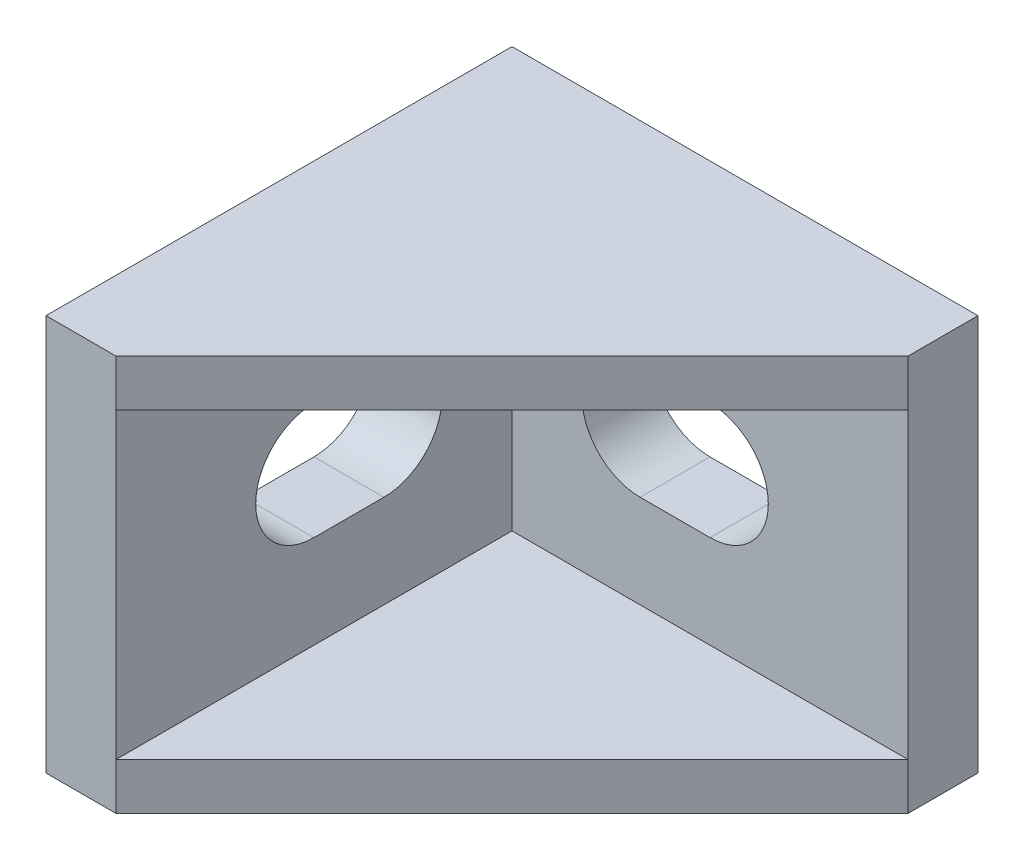
ISO-10303-21;
HEADER;
FILE_DESCRIPTION(('STEP AP214'),'2;1');
FILE_NAME('part.step','',(''),(''),'','','');
FILE_SCHEMA(('AUTOMOTIVE_DESIGN { 1 0 10303 214 1 1 1 1 }'));
ENDSEC;
DATA;
#1=APPLICATION_CONTEXT('core data for automotive mechanical design processes');
#2=APPLICATION_PROTOCOL_DEFINITION('international standard','automotive_design',2000,#1);
#3=PRODUCT_CONTEXT('',#1,'mechanical');
#4=PRODUCT('Part','Part','',(#3));
#5=PRODUCT_RELATED_PRODUCT_CATEGORY('part','',(#4));
#6=PRODUCT_DEFINITION_FORMATION('','',#4);
#7=PRODUCT_DEFINITION_CONTEXT('part definition',#1,'design');
#8=PRODUCT_DEFINITION('design','',#6,#7);
#9=PRODUCT_DEFINITION_SHAPE('','',#8);
#10=(LENGTH_UNIT() NAMED_UNIT(*) SI_UNIT(.MILLI.,.METRE.));
#11=(NAMED_UNIT(*) PLANE_ANGLE_UNIT() SI_UNIT($,.RADIAN.));
#12=(NAMED_UNIT(*) SI_UNIT($,.STERADIAN.) SOLID_ANGLE_UNIT());
#13=UNCERTAINTY_MEASURE_WITH_UNIT(LENGTH_MEASURE(1.E-05),#10,'distance_accuracy_value','');
#14=(GEOMETRIC_REPRESENTATION_CONTEXT(3) GLOBAL_UNCERTAINTY_ASSIGNED_CONTEXT((#13)) GLOBAL_UNIT_ASSIGNED_CONTEXT((#10,
#11,#12)) REPRESENTATION_CONTEXT('',''));
#15=CARTESIAN_POINT('',(0.,0.,0.));
#16=DIRECTION('',(0.,0.,1.));
#17=DIRECTION('',(1.,0.,0.));
#18=AXIS2_PLACEMENT_3D('',#15,#16,#17);
#19=CARTESIAN_POINT('',(10.,2.,10.));
#20=DIRECTION('',(0.,1.,0.));
#21=DIRECTION('',(1.,0.,0.));
#22=AXIS2_PLACEMENT_3D('',#19,#20,#21);
#23=PLANE('',#22);
#24=DIRECTION('',(0.,0.,1.));
#25=VECTOR('',#24,1.);
#26=CARTESIAN_POINT('',(3.,2.,15.));
#27=LINE('',#26,#25);
#28=CARTESIAN_POINT('',(3.,2.,3.00000004470348));
#29=VERTEX_POINT('',#28);
#30=CARTESIAN_POINT('',(3.,2.,20.));
#31=VERTEX_POINT('',#30);
#32=EDGE_CURVE('E212',#29,#31,#27,.T.);
#33=ORIENTED_EDGE('',*,*,#32,.T.);
#34=DIRECTION('',(0.707106781186548,0.,-0.707106781186547));
#35=VECTOR('',#34,1.);
#36=CARTESIAN_POINT('',(20.,2.,3.));
#37=LINE('',#36,#35);
#38=CARTESIAN_POINT('',(20.,2.,3.));
#39=VERTEX_POINT('',#38);
#40=EDGE_CURVE('E24',#31,#39,#37,.T.);
#41=ORIENTED_EDGE('',*,*,#40,.T.);
#42=DIRECTION('',(-1.,0.,2.62961665514434E-09));
#43=VECTOR('',#42,1.);
#44=CARTESIAN_POINT('',(6.49999999079634,2.,3.00000003549983));
#45=LINE('',#44,#43);
#46=EDGE_CURVE('E309',#39,#29,#45,.T.);
#47=ORIENTED_EDGE('',*,*,#46,.T.);
#48=EDGE_LOOP('',(#33,#41,#47));
#49=FACE_BOUND('',#48,.T.);
#50=ADVANCED_FACE('F16',(#49),#23,.T.);
#51=CARTESIAN_POINT('',(0.,0.,20.));
#52=DIRECTION('',(0.,0.,1.));
#53=DIRECTION('',(1.,0.,0.));
#54=AXIS2_PLACEMENT_3D('',#51,#52,#53);
#55=PLANE('',#54);
#56=DIRECTION('',(-1.,0.,0.));
#57=VECTOR('',#56,1.);
#58=CARTESIAN_POINT('',(3.,0.,20.));
#59=LINE('',#58,#57);
#60=CARTESIAN_POINT('',(3.,0.,20.));
#61=VERTEX_POINT('',#60);
#62=CARTESIAN_POINT('',(0.,0.,20.));
#63=VERTEX_POINT('',#62);
#64=EDGE_CURVE('E329',#61,#63,#59,.T.);
#65=ORIENTED_EDGE('',*,*,#64,.F.);
#66=DIRECTION('',(0.,1.,0.));
#67=VECTOR('',#66,1.);
#68=CARTESIAN_POINT('',(3.,0.,20.));
#69=LINE('',#68,#67);
#70=EDGE_CURVE('E11',#61,#31,#69,.T.);
#71=ORIENTED_EDGE('',*,*,#70,.T.);
#72=DIRECTION('',(0.,1.,0.));
#73=VECTOR('',#72,1.);
#74=CARTESIAN_POINT('',(3.,0.,20.));
#75=LINE('',#74,#73);
#76=CARTESIAN_POINT('',(3.,15.,20.));
#77=VERTEX_POINT('',#76);
#78=EDGE_CURVE('E209',#31,#77,#75,.T.);
#79=ORIENTED_EDGE('',*,*,#78,.T.);
#80=DIRECTION('',(0.,1.,0.));
#81=VECTOR('',#80,1.);
#82=CARTESIAN_POINT('',(3.,0.,20.));
#83=LINE('',#82,#81);
#84=CARTESIAN_POINT('',(3.,17.,20.));
#85=VERTEX_POINT('',#84);
#86=EDGE_CURVE('E258',#77,#85,#83,.T.);
#87=ORIENTED_EDGE('',*,*,#86,.T.);
#88=DIRECTION('',(1.,0.,0.));
#89=VECTOR('',#88,1.);
#90=CARTESIAN_POINT('',(3.,17.,20.));
#91=LINE('',#90,#89);
#92=CARTESIAN_POINT('',(0.,17.,20.));
#93=VERTEX_POINT('',#92);
#94=EDGE_CURVE('E326',#93,#85,#91,.T.);
#95=ORIENTED_EDGE('',*,*,#94,.F.);
#96=DIRECTION('',(0.,1.,0.));
#97=VECTOR('',#96,1.);
#98=CARTESIAN_POINT('',(0.,0.,20.));
#99=LINE('',#98,#97);
#100=EDGE_CURVE('E310',#63,#93,#99,.T.);
#101=ORIENTED_EDGE('',*,*,#100,.F.);
#102=EDGE_LOOP('',(#65,#71,#79,#87,#95,#101));
#103=FACE_BOUND('',#102,.T.);
#104=ADVANCED_FACE('F374',(#103),#55,.T.);
#105=CARTESIAN_POINT('',(3.,0.,20.));
#106=DIRECTION('',(0.707106781186547,0.,0.707106781186548));
#107=DIRECTION('',(0.,-1.,0.));
#108=AXIS2_PLACEMENT_3D('',#105,#106,#107);
#109=PLANE('',#108);
#110=DIRECTION('',(-0.707106781186548,0.,0.707106781186547));
#111=VECTOR('',#110,1.);
#112=CARTESIAN_POINT('',(20.,0.,3.));
#113=LINE('',#112,#111);
#114=CARTESIAN_POINT('',(20.,0.,3.));
#115=VERTEX_POINT('',#114);
#116=EDGE_CURVE('E314',#115,#61,#113,.T.);
#117=ORIENTED_EDGE('',*,*,#116,.F.);
#118=DIRECTION('',(0.,1.,0.));
#119=VECTOR('',#118,1.);
#120=CARTESIAN_POINT('',(20.,0.,3.));
#121=LINE('',#120,#119);
#122=EDGE_CURVE('E36',#115,#39,#121,.T.);
#123=ORIENTED_EDGE('',*,*,#122,.T.);
#124=ORIENTED_EDGE('',*,*,#40,.F.);
#125=ORIENTED_EDGE('',*,*,#70,.F.);
#126=EDGE_LOOP('',(#117,#123,#124,#125));
#127=FACE_BOUND('',#126,.T.);
#128=ADVANCED_FACE('F362',(#127),#109,.T.);
#129=CARTESIAN_POINT('',(20.,0.,3.));
#130=DIRECTION('',(1.,0.,0.));
#131=DIRECTION('',(0.,1.,0.));
#132=AXIS2_PLACEMENT_3D('',#129,#130,#131);
#133=PLANE('',#132);
#134=DIRECTION('',(0.,0.,1.));
#135=VECTOR('',#134,1.);
#136=CARTESIAN_POINT('',(20.,0.,0.));
#137=LINE('',#136,#135);
#138=CARTESIAN_POINT('',(20.,0.,0.));
#139=VERTEX_POINT('',#138);
#140=EDGE_CURVE('E343',#139,#115,#137,.T.);
#141=ORIENTED_EDGE('',*,*,#140,.F.);
#142=DIRECTION('',(0.,1.,0.));
#143=VECTOR('',#142,1.);
#144=CARTESIAN_POINT('',(20.,0.,0.));
#145=LINE('',#144,#143);
#146=CARTESIAN_POINT('',(20.,17.,0.));
#147=VERTEX_POINT('',#146);
#148=EDGE_CURVE('E46',#139,#147,#145,.T.);
#149=ORIENTED_EDGE('',*,*,#148,.T.);
#150=DIRECTION('',(0.,0.,-1.));
#151=VECTOR('',#150,1.);
#152=CARTESIAN_POINT('',(20.,17.,0.));
#153=LINE('',#152,#151);
#154=CARTESIAN_POINT('',(20.,17.,3.));
#155=VERTEX_POINT('',#154);
#156=EDGE_CURVE('E237',#155,#147,#153,.T.);
#157=ORIENTED_EDGE('',*,*,#156,.F.);
#158=DIRECTION('',(0.,1.,0.));
#159=VECTOR('',#158,1.);
#160=CARTESIAN_POINT('',(20.,0.,3.));
#161=LINE('',#160,#159);
#162=CARTESIAN_POINT('',(20.,15.,3.));
#163=VERTEX_POINT('',#162);
#164=EDGE_CURVE('E257',#163,#155,#161,.T.);
#165=ORIENTED_EDGE('',*,*,#164,.F.);
#166=DIRECTION('',(0.,1.,0.));
#167=VECTOR('',#166,1.);
#168=CARTESIAN_POINT('',(20.,0.,3.));
#169=LINE('',#168,#167);
#170=EDGE_CURVE('E242',#39,#163,#169,.T.);
#171=ORIENTED_EDGE('',*,*,#170,.F.);
#172=ORIENTED_EDGE('',*,*,#122,.F.);
#173=EDGE_LOOP('',(#141,#149,#157,#165,#171,#172));
#174=FACE_BOUND('',#173,.T.);
#175=ADVANCED_FACE('F364',(#174),#133,.T.);
#176=CARTESIAN_POINT('',(20.,0.,0.));
#177=DIRECTION('',(0.,0.,-1.));
#178=DIRECTION('',(0.,-1.,0.));
#179=AXIS2_PLACEMENT_3D('',#176,#177,#178);
#180=PLANE('',#179);
#181=DIRECTION('',(1.,0.,0.));
#182=VECTOR('',#181,1.);
#183=CARTESIAN_POINT('',(14.25,6.,0.));
#184=LINE('',#183,#182);
#185=CARTESIAN_POINT('',(8.5,6.,0.));
#186=VERTEX_POINT('',#185);
#187=CARTESIAN_POINT('',(11.5,6.,0.));
#188=VERTEX_POINT('',#187);
#189=EDGE_CURVE('E183',#186,#188,#184,.T.);
#190=ORIENTED_EDGE('',*,*,#189,.T.);
#191=CARTESIAN_POINT('',(11.5,8.5,0.));
#192=DIRECTION('',(0.,0.,1.));
#193=DIRECTION('',(0.,-1.,0.));
#194=AXIS2_PLACEMENT_3D('',#191,#192,#193);
#195=CIRCLE('',#194,2.5);
#196=CARTESIAN_POINT('',(11.5,11.,0.));
#197=VERTEX_POINT('',#196);
#198=EDGE_CURVE('E168',#188,#197,#195,.T.);
#199=ORIENTED_EDGE('',*,*,#198,.T.);
#200=DIRECTION('',(-1.,0.,0.));
#201=VECTOR('',#200,1.);
#202=CARTESIAN_POINT('',(15.75,11.,0.));
#203=LINE('',#202,#201);
#204=CARTESIAN_POINT('',(8.5,11.,0.));
#205=VERTEX_POINT('',#204);
#206=EDGE_CURVE('E230',#197,#205,#203,.T.);
#207=ORIENTED_EDGE('',*,*,#206,.T.);
#208=CARTESIAN_POINT('',(8.5,8.5,0.));
#209=DIRECTION('',(0.,0.,1.));
#210=DIRECTION('',(0.,1.,0.));
#211=AXIS2_PLACEMENT_3D('',#208,#209,#210);
#212=CIRCLE('',#211,2.5);
#213=EDGE_CURVE('E186',#205,#186,#212,.T.);
#214=ORIENTED_EDGE('',*,*,#213,.T.);
#215=EDGE_LOOP('',(#190,#199,#207,#214));
#216=FACE_BOUND('',#215,.T.);
#217=DIRECTION('',(1.,0.,0.));
#218=VECTOR('',#217,1.);
#219=CARTESIAN_POINT('',(0.,0.,0.));
#220=LINE('',#219,#218);
#221=CARTESIAN_POINT('',(0.,0.,0.));
#222=VERTEX_POINT('',#221);
#223=EDGE_CURVE('E339',#222,#139,#220,.T.);
#224=ORIENTED_EDGE('',*,*,#223,.F.);
#225=DIRECTION('',(0.,1.,0.));
#226=VECTOR('',#225,1.);
#227=CARTESIAN_POINT('',(0.,0.,0.));
#228=LINE('',#227,#226);
#229=CARTESIAN_POINT('',(0.,17.,0.));
#230=VERTEX_POINT('',#229);
#231=EDGE_CURVE('E313',#222,#230,#228,.T.);
#232=ORIENTED_EDGE('',*,*,#231,.T.);
#233=DIRECTION('',(-1.,0.,0.));
#234=VECTOR('',#233,1.);
#235=CARTESIAN_POINT('',(0.,17.,0.));
#236=LINE('',#235,#234);
#237=EDGE_CURVE('E241',#147,#230,#236,.T.);
#238=ORIENTED_EDGE('',*,*,#237,.F.);
#239=ORIENTED_EDGE('',*,*,#148,.F.);
#240=EDGE_LOOP('',(#224,#232,#238,#239));
#241=FACE_BOUND('',#240,.T.);
#242=ADVANCED_FACE('F184',(#216,#241),#180,.T.);
#243=CARTESIAN_POINT('',(0.,0.,0.));
#244=DIRECTION('',(-1.,0.,0.));
#245=DIRECTION('',(0.,0.,1.));
#246=AXIS2_PLACEMENT_3D('',#243,#244,#245);
#247=PLANE('',#246);
#248=DIRECTION('',(0.,0.,1.));
#249=VECTOR('',#248,1.);
#250=CARTESIAN_POINT('',(0.,11.,4.25));
#251=LINE('',#250,#249);
#252=CARTESIAN_POINT('',(0.,11.,8.5));
#253=VERTEX_POINT('',#252);
#254=CARTESIAN_POINT('',(0.,11.,11.5));
#255=VERTEX_POINT('',#254);
#256=EDGE_CURVE('E208',#253,#255,#251,.T.);
#257=ORIENTED_EDGE('',*,*,#256,.T.);
#258=CARTESIAN_POINT('',(0.,8.5,11.5));
#259=DIRECTION('',(1.,0.,0.));
#260=DIRECTION('',(0.,-1.,0.));
#261=AXIS2_PLACEMENT_3D('',#258,#259,#260);
#262=CIRCLE('',#261,2.5);
#263=CARTESIAN_POINT('',(0.,6.,11.5));
#264=VERTEX_POINT('',#263);
#265=EDGE_CURVE('E278',#255,#264,#262,.T.);
#266=ORIENTED_EDGE('',*,*,#265,.T.);
#267=DIRECTION('',(0.,0.,-1.));
#268=VECTOR('',#267,1.);
#269=CARTESIAN_POINT('',(0.,6.,5.75));
#270=LINE('',#269,#268);
#271=CARTESIAN_POINT('',(0.,6.,8.5));
#272=VERTEX_POINT('',#271);
#273=EDGE_CURVE('E277',#264,#272,#270,.T.);
#274=ORIENTED_EDGE('',*,*,#273,.T.);
#275=CARTESIAN_POINT('',(0.,8.5,8.5));
#276=DIRECTION('',(1.,0.,0.));
#277=DIRECTION('',(0.,1.,0.));
#278=AXIS2_PLACEMENT_3D('',#275,#276,#277);
#279=CIRCLE('',#278,2.5);
#280=EDGE_CURVE('E262',#272,#253,#279,.T.);
#281=ORIENTED_EDGE('',*,*,#280,.T.);
#282=EDGE_LOOP('',(#257,#266,#274,#281));
#283=FACE_BOUND('',#282,.T.);
#284=DIRECTION('',(0.,0.,-1.));
#285=VECTOR('',#284,1.);
#286=CARTESIAN_POINT('',(0.,0.,20.));
#287=LINE('',#286,#285);
#288=EDGE_CURVE('E335',#63,#222,#287,.T.);
#289=ORIENTED_EDGE('',*,*,#288,.F.);
#290=ORIENTED_EDGE('',*,*,#100,.T.);
#291=DIRECTION('',(0.,0.,1.));
#292=VECTOR('',#291,1.);
#293=CARTESIAN_POINT('',(0.,17.,20.));
#294=LINE('',#293,#292);
#295=EDGE_CURVE('E322',#230,#93,#294,.T.);
#296=ORIENTED_EDGE('',*,*,#295,.F.);
#297=ORIENTED_EDGE('',*,*,#231,.F.);
#298=EDGE_LOOP('',(#289,#290,#296,#297));
#299=FACE_BOUND('',#298,.T.);
#300=ADVANCED_FACE('F416',(#283,#299),#247,.T.);
#301=CARTESIAN_POINT('',(10.,0.,10.));
#302=DIRECTION('',(0.,1.,0.));
#303=DIRECTION('',(1.,0.,0.));
#304=AXIS2_PLACEMENT_3D('',#301,#302,#303);
#305=PLANE('',#304);
#306=ORIENTED_EDGE('',*,*,#64,.T.);
#307=ORIENTED_EDGE('',*,*,#288,.T.);
#308=ORIENTED_EDGE('',*,*,#223,.T.);
#309=ORIENTED_EDGE('',*,*,#140,.T.);
#310=ORIENTED_EDGE('',*,*,#116,.T.);
#311=EDGE_LOOP('',(#306,#307,#308,#309,#310));
#312=FACE_BOUND('',#311,.T.);
#313=ADVANCED_FACE('F378',(#312),#305,.F.);
#314=CARTESIAN_POINT('',(10.,17.,10.));
#315=DIRECTION('',(0.,1.,0.));
#316=DIRECTION('',(1.,0.,0.));
#317=AXIS2_PLACEMENT_3D('',#314,#315,#316);
#318=PLANE('',#317);
#319=DIRECTION('',(-0.707106781186548,0.,0.707106781186547));
#320=VECTOR('',#319,1.);
#321=CARTESIAN_POINT('',(7.25,17.,15.75));
#322=LINE('',#321,#320);
#323=EDGE_CURVE('E281',#155,#85,#322,.T.);
#324=ORIENTED_EDGE('',*,*,#323,.F.);
#325=ORIENTED_EDGE('',*,*,#156,.T.);
#326=ORIENTED_EDGE('',*,*,#237,.T.);
#327=ORIENTED_EDGE('',*,*,#295,.T.);
#328=ORIENTED_EDGE('',*,*,#94,.T.);
#329=EDGE_LOOP('',(#324,#325,#326,#327,#328));
#330=FACE_BOUND('',#329,.T.);
#331=ADVANCED_FACE('F382',(#330),#318,.T.);
#332=CARTESIAN_POINT('',(3.,0.,3.00000004470348));
#333=DIRECTION('',(2.62961665514434E-09,0.,1.));
#334=DIRECTION('',(0.,-1.,0.));
#335=AXIS2_PLACEMENT_3D('',#332,#333,#334);
#336=PLANE('',#335);
#337=DIRECTION('',(-1.,0.,2.62961665514434E-09));
#338=VECTOR('',#337,1.);
#339=CARTESIAN_POINT('',(5.75000000394443,6.,3.00000003747204));
#340=LINE('',#339,#338);
#341=CARTESIAN_POINT('',(11.5,6.,3.00000002235174));
#342=VERTEX_POINT('',#341);
#343=CARTESIAN_POINT('',(8.5,6.,3.00000003024059));
#344=VERTEX_POINT('',#343);
#345=EDGE_CURVE('E195',#342,#344,#340,.T.);
#346=ORIENTED_EDGE('',*,*,#345,.T.);
#347=CARTESIAN_POINT('',(8.5,8.5,3.00000003024059));
#348=DIRECTION('',(-2.62961665514434E-09,0.,-1.));
#349=DIRECTION('',(0.,1.,0.));
#350=AXIS2_PLACEMENT_3D('',#347,#348,#349);
#351=CIRCLE('',#350,2.5);
#352=CARTESIAN_POINT('',(8.5,11.,3.00000003024059));
#353=VERTEX_POINT('',#352);
#354=EDGE_CURVE('E216',#344,#353,#351,.T.);
#355=ORIENTED_EDGE('',*,*,#354,.T.);
#356=DIRECTION('',(1.,0.,-2.62961665514434E-09));
#357=VECTOR('',#356,1.);
#358=CARTESIAN_POINT('',(7.25000000394443,11.,3.00000003352761));
#359=LINE('',#358,#357);
#360=CARTESIAN_POINT('',(11.5,11.,3.00000002235174));
#361=VERTEX_POINT('',#360);
#362=EDGE_CURVE('E226',#353,#361,#359,.T.);
#363=ORIENTED_EDGE('',*,*,#362,.T.);
#364=CARTESIAN_POINT('',(11.5,8.5,3.00000002235174));
#365=DIRECTION('',(-2.62961665514434E-09,0.,-1.));
#366=DIRECTION('',(0.,-1.,0.));
#367=AXIS2_PLACEMENT_3D('',#364,#365,#366);
#368=CIRCLE('',#367,2.5);
#369=EDGE_CURVE('E180',#361,#342,#368,.T.);
#370=ORIENTED_EDGE('',*,*,#369,.T.);
#371=EDGE_LOOP('',(#346,#355,#363,#370));
#372=FACE_BOUND('',#371,.T.);
#373=DIRECTION('',(-1.,0.,2.62961665514434E-09));
#374=VECTOR('',#373,1.);
#375=CARTESIAN_POINT('',(7.24999998882413,15.,3.00000003352761));
#376=LINE('',#375,#374);
#377=CARTESIAN_POINT('',(3.,15.,3.00000004470348));
#378=VERTEX_POINT('',#377);
#379=EDGE_CURVE('E263',#163,#378,#376,.T.);
#380=ORIENTED_EDGE('',*,*,#379,.T.);
#381=DIRECTION('',(0.,1.,0.));
#382=VECTOR('',#381,1.);
#383=CARTESIAN_POINT('',(3.,0.,3.00000004470348));
#384=LINE('',#383,#382);
#385=EDGE_CURVE('E306',#29,#378,#384,.T.);
#386=ORIENTED_EDGE('',*,*,#385,.F.);
#387=ORIENTED_EDGE('',*,*,#46,.F.);
#388=ORIENTED_EDGE('',*,*,#170,.T.);
#389=EDGE_LOOP('',(#380,#386,#387,#388));
#390=FACE_BOUND('',#389,.T.);
#391=ADVANCED_FACE('F368',(#372,#390),#336,.T.);
#392=CARTESIAN_POINT('',(3.,0.,20.));
#393=DIRECTION('',(1.,0.,0.));
#394=DIRECTION('',(0.,1.,0.));
#395=AXIS2_PLACEMENT_3D('',#392,#393,#394);
#396=PLANE('',#395);
#397=DIRECTION('',(0.,0.,-1.));
#398=VECTOR('',#397,1.);
#399=CARTESIAN_POINT('',(3.,11.,14.25));
#400=LINE('',#399,#398);
#401=CARTESIAN_POINT('',(3.,11.,11.5));
#402=VERTEX_POINT('',#401);
#403=CARTESIAN_POINT('',(3.,11.,8.5));
#404=VERTEX_POINT('',#403);
#405=EDGE_CURVE('E179',#402,#404,#400,.T.);
#406=ORIENTED_EDGE('',*,*,#405,.T.);
#407=CARTESIAN_POINT('',(3.,8.5,8.5));
#408=DIRECTION('',(-1.,0.,0.));
#409=DIRECTION('',(0.,1.,0.));
#410=AXIS2_PLACEMENT_3D('',#407,#408,#409);
#411=CIRCLE('',#410,2.5);
#412=CARTESIAN_POINT('',(3.,6.,8.5));
#413=VERTEX_POINT('',#412);
#414=EDGE_CURVE('E207',#404,#413,#411,.T.);
#415=ORIENTED_EDGE('',*,*,#414,.T.);
#416=DIRECTION('',(0.,0.,1.));
#417=VECTOR('',#416,1.);
#418=CARTESIAN_POINT('',(3.,6.,15.75));
#419=LINE('',#418,#417);
#420=CARTESIAN_POINT('',(3.,6.,11.5));
#421=VERTEX_POINT('',#420);
#422=EDGE_CURVE('E273',#413,#421,#419,.T.);
#423=ORIENTED_EDGE('',*,*,#422,.T.);
#424=CARTESIAN_POINT('',(3.,8.5,11.5));
#425=DIRECTION('',(-1.,0.,0.));
#426=DIRECTION('',(0.,-1.,0.));
#427=AXIS2_PLACEMENT_3D('',#424,#425,#426);
#428=CIRCLE('',#427,2.5);
#429=EDGE_CURVE('E282',#421,#402,#428,.T.);
#430=ORIENTED_EDGE('',*,*,#429,.T.);
#431=EDGE_LOOP('',(#406,#415,#423,#430));
#432=FACE_BOUND('',#431,.T.);
#433=DIRECTION('',(0.,0.,1.));
#434=VECTOR('',#433,1.);
#435=CARTESIAN_POINT('',(3.,15.,15.75));
#436=LINE('',#435,#434);
#437=EDGE_CURVE('E213',#378,#77,#436,.T.);
#438=ORIENTED_EDGE('',*,*,#437,.T.);
#439=ORIENTED_EDGE('',*,*,#78,.F.);
#440=ORIENTED_EDGE('',*,*,#32,.F.);
#441=ORIENTED_EDGE('',*,*,#385,.T.);
#442=EDGE_LOOP('',(#438,#439,#440,#441));
#443=FACE_BOUND('',#442,.T.);
#444=ADVANCED_FACE('F371',(#432,#443),#396,.T.);
#445=CARTESIAN_POINT('',(11.5,15.,11.5));
#446=DIRECTION('',(0.,-1.,0.));
#447=DIRECTION('',(0.,0.,-1.));
#448=AXIS2_PLACEMENT_3D('',#445,#446,#447);
#449=PLANE('',#448);
#450=ORIENTED_EDGE('',*,*,#379,.F.);
#451=DIRECTION('',(-0.707106781186548,0.,0.707106781186547));
#452=VECTOR('',#451,1.);
#453=CARTESIAN_POINT('',(7.25,15.,15.75));
#454=LINE('',#453,#452);
#455=EDGE_CURVE('E253',#163,#77,#454,.T.);
#456=ORIENTED_EDGE('',*,*,#455,.T.);
#457=ORIENTED_EDGE('',*,*,#437,.F.);
#458=EDGE_LOOP('',(#450,#456,#457));
#459=FACE_BOUND('',#458,.T.);
#460=ADVANCED_FACE('F386',(#459),#449,.T.);
#461=CARTESIAN_POINT('',(20.,17.,3.));
#462=DIRECTION('',(0.707106781186547,0.,0.707106781186548));
#463=DIRECTION('',(0.,-1.,0.));
#464=AXIS2_PLACEMENT_3D('',#461,#462,#463);
#465=PLANE('',#464);
#466=ORIENTED_EDGE('',*,*,#323,.T.);
#467=ORIENTED_EDGE('',*,*,#86,.F.);
#468=ORIENTED_EDGE('',*,*,#455,.F.);
#469=ORIENTED_EDGE('',*,*,#164,.T.);
#470=EDGE_LOOP('',(#466,#467,#468,#469));
#471=FACE_BOUND('',#470,.T.);
#472=ADVANCED_FACE('F384',(#471),#465,.T.);
#473=CARTESIAN_POINT('',(0.,8.5,11.5));
#474=DIRECTION('',(1.,0.,0.));
#475=DIRECTION('',(0.,-1.,0.));
#476=AXIS2_PLACEMENT_3D('',#473,#474,#475);
#477=CYLINDRICAL_SURFACE('',#476,2.5);
#478=ORIENTED_EDGE('',*,*,#429,.F.);
#479=DIRECTION('',(1.,0.,0.));
#480=VECTOR('',#479,1.);
#481=CARTESIAN_POINT('',(0.,6.,11.5));
#482=LINE('',#481,#480);
#483=EDGE_CURVE('E285',#264,#421,#482,.T.);
#484=ORIENTED_EDGE('',*,*,#483,.F.);
#485=ORIENTED_EDGE('',*,*,#265,.F.);
#486=DIRECTION('',(1.,0.,0.));
#487=VECTOR('',#486,1.);
#488=CARTESIAN_POINT('',(0.,11.,11.5));
#489=LINE('',#488,#487);
#490=EDGE_CURVE('E246',#255,#402,#489,.T.);
#491=ORIENTED_EDGE('',*,*,#490,.T.);
#492=EDGE_LOOP('',(#478,#484,#485,#491));
#493=FACE_BOUND('',#492,.T.);
#494=ADVANCED_FACE('F394',(#493),#477,.F.);
#495=CARTESIAN_POINT('',(0.,6.,11.5));
#496=DIRECTION('',(0.,-1.,0.));
#497=DIRECTION('',(0.,0.,-1.));
#498=AXIS2_PLACEMENT_3D('',#495,#496,#497);
#499=PLANE('',#498);
#500=ORIENTED_EDGE('',*,*,#422,.F.);
#501=DIRECTION('',(1.,0.,0.));
#502=VECTOR('',#501,1.);
#503=CARTESIAN_POINT('',(0.,6.,8.5));
#504=LINE('',#503,#502);
#505=EDGE_CURVE('E269',#272,#413,#504,.T.);
#506=ORIENTED_EDGE('',*,*,#505,.F.);
#507=ORIENTED_EDGE('',*,*,#273,.F.);
#508=ORIENTED_EDGE('',*,*,#483,.T.);
#509=EDGE_LOOP('',(#500,#506,#507,#508));
#510=FACE_BOUND('',#509,.T.);
#511=ADVANCED_FACE('F443',(#510),#499,.F.);
#512=CARTESIAN_POINT('',(0.,8.5,8.5));
#513=DIRECTION('',(1.,0.,0.));
#514=DIRECTION('',(0.,1.,0.));
#515=AXIS2_PLACEMENT_3D('',#512,#513,#514);
#516=CYLINDRICAL_SURFACE('',#515,2.5);
#517=ORIENTED_EDGE('',*,*,#414,.F.);
#518=DIRECTION('',(1.,0.,0.));
#519=VECTOR('',#518,1.);
#520=CARTESIAN_POINT('',(0.,11.,8.5));
#521=LINE('',#520,#519);
#522=EDGE_CURVE('E203',#253,#404,#521,.T.);
#523=ORIENTED_EDGE('',*,*,#522,.F.);
#524=ORIENTED_EDGE('',*,*,#280,.F.);
#525=ORIENTED_EDGE('',*,*,#505,.T.);
#526=EDGE_LOOP('',(#517,#523,#524,#525));
#527=FACE_BOUND('',#526,.T.);
#528=ADVANCED_FACE('F441',(#527),#516,.F.);
#529=CARTESIAN_POINT('',(0.,11.,8.5));
#530=DIRECTION('',(0.,1.,0.));
#531=DIRECTION('',(0.,0.,-1.));
#532=AXIS2_PLACEMENT_3D('',#529,#530,#531);
#533=PLANE('',#532);
#534=ORIENTED_EDGE('',*,*,#405,.F.);
#535=ORIENTED_EDGE('',*,*,#490,.F.);
#536=ORIENTED_EDGE('',*,*,#256,.F.);
#537=ORIENTED_EDGE('',*,*,#522,.T.);
#538=EDGE_LOOP('',(#534,#535,#536,#537));
#539=FACE_BOUND('',#538,.T.);
#540=ADVANCED_FACE('F437',(#539),#533,.F.);
#541=CARTESIAN_POINT('',(11.5,8.5,0.));
#542=DIRECTION('',(0.,0.,1.));
#543=DIRECTION('',(0.,-1.,0.));
#544=AXIS2_PLACEMENT_3D('',#541,#542,#543);
#545=CYLINDRICAL_SURFACE('',#544,2.5);
#546=ORIENTED_EDGE('',*,*,#369,.F.);
#547=DIRECTION('',(0.,0.,1.));
#548=VECTOR('',#547,1.);
#549=CARTESIAN_POINT('',(11.5,11.,0.));
#550=LINE('',#549,#548);
#551=EDGE_CURVE('E175',#197,#361,#550,.T.);
#552=ORIENTED_EDGE('',*,*,#551,.F.);
#553=ORIENTED_EDGE('',*,*,#198,.F.);
#554=DIRECTION('',(0.,0.,1.));
#555=VECTOR('',#554,1.);
#556=CARTESIAN_POINT('',(11.5,6.,0.));
#557=LINE('',#556,#555);
#558=EDGE_CURVE('E172',#188,#342,#557,.T.);
#559=ORIENTED_EDGE('',*,*,#558,.T.);
#560=EDGE_LOOP('',(#546,#552,#553,#559));
#561=FACE_BOUND('',#560,.T.);
#562=ADVANCED_FACE('F170',(#561),#545,.F.);
#563=CARTESIAN_POINT('',(11.5,11.,0.));
#564=DIRECTION('',(0.,1.,0.));
#565=DIRECTION('',(1.,0.,0.));
#566=AXIS2_PLACEMENT_3D('',#563,#564,#565);
#567=PLANE('',#566);
#568=ORIENTED_EDGE('',*,*,#362,.F.);
#569=DIRECTION('',(0.,0.,1.));
#570=VECTOR('',#569,1.);
#571=CARTESIAN_POINT('',(8.5,11.,0.));
#572=LINE('',#571,#570);
#573=EDGE_CURVE('E222',#205,#353,#572,.T.);
#574=ORIENTED_EDGE('',*,*,#573,.F.);
#575=ORIENTED_EDGE('',*,*,#206,.F.);
#576=ORIENTED_EDGE('',*,*,#551,.T.);
#577=EDGE_LOOP('',(#568,#574,#575,#576));
#578=FACE_BOUND('',#577,.T.);
#579=ADVANCED_FACE('F433',(#578),#567,.F.);
#580=CARTESIAN_POINT('',(8.5,8.5,0.));
#581=DIRECTION('',(0.,0.,1.));
#582=DIRECTION('',(0.,1.,0.));
#583=AXIS2_PLACEMENT_3D('',#580,#581,#582);
#584=CYLINDRICAL_SURFACE('',#583,2.5);
#585=ORIENTED_EDGE('',*,*,#354,.F.);
#586=DIRECTION('',(0.,0.,1.));
#587=VECTOR('',#586,1.);
#588=CARTESIAN_POINT('',(8.5,6.,0.));
#589=LINE('',#588,#587);
#590=EDGE_CURVE('E191',#186,#344,#589,.T.);
#591=ORIENTED_EDGE('',*,*,#590,.F.);
#592=ORIENTED_EDGE('',*,*,#213,.F.);
#593=ORIENTED_EDGE('',*,*,#573,.T.);
#594=EDGE_LOOP('',(#585,#591,#592,#593));
#595=FACE_BOUND('',#594,.T.);
#596=ADVANCED_FACE('F430',(#595),#584,.F.);
#597=CARTESIAN_POINT('',(8.5,6.,0.));
#598=DIRECTION('',(0.,-1.,0.));
#599=DIRECTION('',(-1.,0.,0.));
#600=AXIS2_PLACEMENT_3D('',#597,#598,#599);
#601=PLANE('',#600);
#602=ORIENTED_EDGE('',*,*,#345,.F.);
#603=ORIENTED_EDGE('',*,*,#558,.F.);
#604=ORIENTED_EDGE('',*,*,#189,.F.);
#605=ORIENTED_EDGE('',*,*,#590,.T.);
#606=EDGE_LOOP('',(#602,#603,#604,#605));
#607=FACE_BOUND('',#606,.T.);
#608=ADVANCED_FACE('F193',(#607),#601,.F.);
#609=CLOSED_SHELL('',(#50,#104,#128,#175,#242,#300,#313,#331,#391,#444,#460,#472,#494,#511,#528,
#540,#562,#579,#596,#608));
#610=MANIFOLD_SOLID_BREP('B1',#609);
#611=ADVANCED_BREP_SHAPE_REPRESENTATION('',(#18,#610),#14);
#612=SHAPE_DEFINITION_REPRESENTATION(#9,#611);
ENDSEC;
END-ISO-10303-21;
